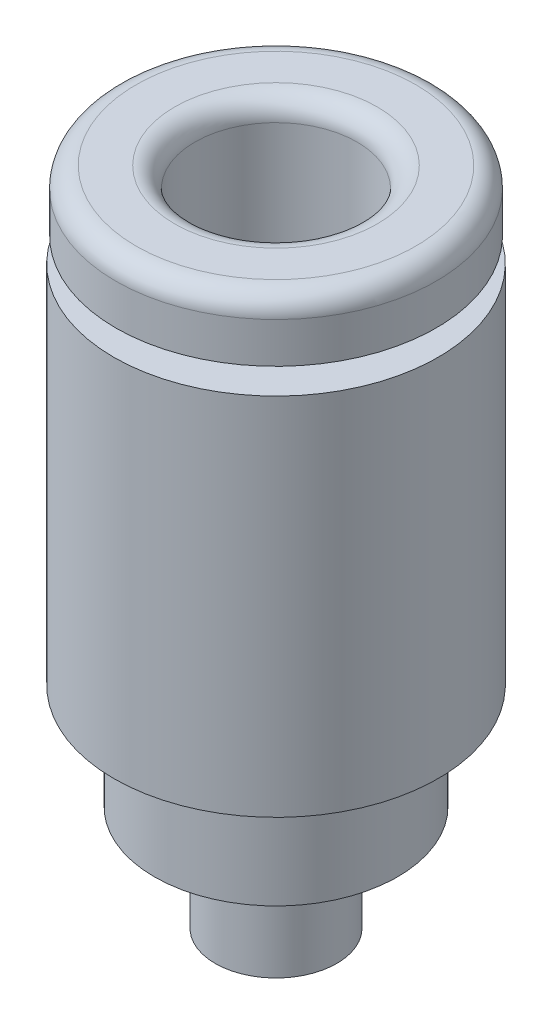
ISO-10303-21;
HEADER;
FILE_DESCRIPTION(('STEP AP214'),'2;1');
FILE_NAME('part.step','',(''),(''),'','','');
FILE_SCHEMA(('AUTOMOTIVE_DESIGN { 1 0 10303 214 1 1 1 1 }'));
ENDSEC;
DATA;
#1=APPLICATION_CONTEXT('core data for automotive mechanical design processes');
#2=APPLICATION_PROTOCOL_DEFINITION('international standard','automotive_design',2000,#1);
#3=PRODUCT_CONTEXT('',#1,'mechanical');
#4=PRODUCT('Part','Part','',(#3));
#5=PRODUCT_RELATED_PRODUCT_CATEGORY('part','',(#4));
#6=PRODUCT_DEFINITION_FORMATION('','',#4);
#7=PRODUCT_DEFINITION_CONTEXT('part definition',#1,'design');
#8=PRODUCT_DEFINITION('design','',#6,#7);
#9=PRODUCT_DEFINITION_SHAPE('','',#8);
#10=(LENGTH_UNIT() NAMED_UNIT(*) SI_UNIT(.MILLI.,.METRE.));
#11=(NAMED_UNIT(*) PLANE_ANGLE_UNIT() SI_UNIT($,.RADIAN.));
#12=(NAMED_UNIT(*) SI_UNIT($,.STERADIAN.) SOLID_ANGLE_UNIT());
#13=UNCERTAINTY_MEASURE_WITH_UNIT(LENGTH_MEASURE(1.E-05),#10,'distance_accuracy_value','');
#14=(GEOMETRIC_REPRESENTATION_CONTEXT(3) GLOBAL_UNCERTAINTY_ASSIGNED_CONTEXT((#13)) GLOBAL_UNIT_ASSIGNED_CONTEXT((#10,
#11,#12)) REPRESENTATION_CONTEXT('',''));
#15=CARTESIAN_POINT('',(0.,0.,0.));
#16=DIRECTION('',(0.,0.,1.));
#17=DIRECTION('',(1.,0.,0.));
#18=AXIS2_PLACEMENT_3D('',#15,#16,#17);
#19=CARTESIAN_POINT('',(0.866025403784439,-16.3,0.));
#20=DIRECTION('',(0.866025403784439,0.,0.5));
#21=DIRECTION('',(0.5,0.,-0.866025403784439));
#22=AXIS2_PLACEMENT_3D('',#19,#20,#21);
#23=PLANE('',#22);
#24=DIRECTION('',(0.,1.,0.));
#25=VECTOR('',#24,1.);
#26=CARTESIAN_POINT('',(0.866025403784439,-16.3,0.));
#27=LINE('',#26,#25);
#28=CARTESIAN_POINT('',(0.866025403784439,-12.7,0.));
#29=VERTEX_POINT('',#28);
#30=CARTESIAN_POINT('',(0.866025403784439,-16.3,0.));
#31=VERTEX_POINT('',#30);
#32=EDGE_CURVE('E93',#29,#31,#27,.F.);
#33=ORIENTED_EDGE('',*,*,#32,.T.);
#34=DIRECTION('',(0.5,0.,-0.866025403784439));
#35=VECTOR('',#34,1.);
#36=CARTESIAN_POINT('',(0.866025403784439,-16.3,0.));
#37=LINE('',#36,#35);
#38=CARTESIAN_POINT('',(0.433012701892219,-16.3,0.75));
#39=VERTEX_POINT('',#38);
#40=EDGE_CURVE('E82',#39,#31,#37,.T.);
#41=ORIENTED_EDGE('',*,*,#40,.F.);
#42=DIRECTION('',(0.,1.,0.));
#43=VECTOR('',#42,1.);
#44=CARTESIAN_POINT('',(0.433012701892219,-16.3,0.75));
#45=LINE('',#44,#43);
#46=CARTESIAN_POINT('',(0.433012701892219,-12.7,0.75));
#47=VERTEX_POINT('',#46);
#48=EDGE_CURVE('E258',#39,#47,#45,.T.);
#49=ORIENTED_EDGE('',*,*,#48,.T.);
#50=DIRECTION('',(0.5,0.,-0.866025403784439));
#51=VECTOR('',#50,1.);
#52=CARTESIAN_POINT('',(0.866025403784439,-12.7,0.));
#53=LINE('',#52,#51);
#54=EDGE_CURVE('E77',#29,#47,#53,.F.);
#55=ORIENTED_EDGE('',*,*,#54,.F.);
#56=EDGE_LOOP('',(#33,#41,#49,#55));
#57=FACE_BOUND('',#56,.T.);
#58=ADVANCED_FACE('F16',(#57),#23,.F.);
#59=CARTESIAN_POINT('',(0.433012701892219,-16.3,-0.75));
#60=DIRECTION('',(0.866025403784439,0.,-0.5));
#61=DIRECTION('',(-0.5,0.,-0.866025403784439));
#62=AXIS2_PLACEMENT_3D('',#59,#60,#61);
#63=PLANE('',#62);
#64=DIRECTION('',(0.,1.,0.));
#65=VECTOR('',#64,1.);
#66=CARTESIAN_POINT('',(0.433012701892219,-16.3,-0.75));
#67=LINE('',#66,#65);
#68=CARTESIAN_POINT('',(0.433012701892219,-12.7,-0.75));
#69=VERTEX_POINT('',#68);
#70=CARTESIAN_POINT('',(0.433012701892219,-16.3,-0.75));
#71=VERTEX_POINT('',#70);
#72=EDGE_CURVE('E98',#69,#71,#67,.F.);
#73=ORIENTED_EDGE('',*,*,#72,.T.);
#74=DIRECTION('',(-0.5,0.,-0.866025403784439));
#75=VECTOR('',#74,1.);
#76=CARTESIAN_POINT('',(0.433012701892219,-16.3,-0.75));
#77=LINE('',#76,#75);
#78=EDGE_CURVE('E86',#31,#71,#77,.T.);
#79=ORIENTED_EDGE('',*,*,#78,.F.);
#80=ORIENTED_EDGE('',*,*,#32,.F.);
#81=DIRECTION('',(-0.5,0.,-0.866025403784439));
#82=VECTOR('',#81,1.);
#83=CARTESIAN_POINT('',(0.433012701892219,-12.7,-0.75));
#84=LINE('',#83,#82);
#85=EDGE_CURVE('E100',#69,#29,#84,.F.);
#86=ORIENTED_EDGE('',*,*,#85,.F.);
#87=EDGE_LOOP('',(#73,#79,#80,#86));
#88=FACE_BOUND('',#87,.T.);
#89=ADVANCED_FACE('F96',(#88),#63,.F.);
#90=CARTESIAN_POINT('',(0.433012701892219,-16.3,0.75));
#91=DIRECTION('',(0.,0.,1.));
#92=DIRECTION('',(1.,0.,0.));
#93=AXIS2_PLACEMENT_3D('',#90,#91,#92);
#94=PLANE('',#93);
#95=ORIENTED_EDGE('',*,*,#48,.F.);
#96=DIRECTION('',(1.,0.,0.));
#97=VECTOR('',#96,1.);
#98=CARTESIAN_POINT('',(0.433012701892219,-16.3,0.75));
#99=LINE('',#98,#97);
#100=CARTESIAN_POINT('',(-0.433012701892219,-16.3,0.75));
#101=VERTEX_POINT('',#100);
#102=EDGE_CURVE('E89',#101,#39,#99,.T.);
#103=ORIENTED_EDGE('',*,*,#102,.F.);
#104=DIRECTION('',(0.,1.,0.));
#105=VECTOR('',#104,1.);
#106=CARTESIAN_POINT('',(-0.433012701892219,-16.3,0.75));
#107=LINE('',#106,#105);
#108=CARTESIAN_POINT('',(-0.433012701892219,-12.7,0.75));
#109=VERTEX_POINT('',#108);
#110=EDGE_CURVE('E246',#101,#109,#107,.T.);
#111=ORIENTED_EDGE('',*,*,#110,.T.);
#112=DIRECTION('',(1.,0.,0.));
#113=VECTOR('',#112,1.);
#114=CARTESIAN_POINT('',(0.433012701892219,-12.7,0.75));
#115=LINE('',#114,#113);
#116=EDGE_CURVE('E254',#47,#109,#115,.F.);
#117=ORIENTED_EDGE('',*,*,#116,.F.);
#118=EDGE_LOOP('',(#95,#103,#111,#117));
#119=FACE_BOUND('',#118,.T.);
#120=ADVANCED_FACE('F261',(#119),#94,.F.);
#121=CARTESIAN_POINT('',(0.,0.,0.));
#122=DIRECTION('',(0.,1.,0.));
#123=DIRECTION('',(-1.,0.,0.));
#124=AXIS2_PLACEMENT_3D('',#121,#122,#123);
#125=CYLINDRICAL_SURFACE('',#124,2.);
#126=CARTESIAN_POINT('',(0.,-12.7,0.));
#127=DIRECTION('',(0.,1.,0.));
#128=DIRECTION('',(-1.,0.,0.));
#129=AXIS2_PLACEMENT_3D('',#126,#127,#128);
#130=CIRCLE('',#129,2.);
#131=CARTESIAN_POINT('',(-2.,-12.7,0.));
#132=VERTEX_POINT('',#131);
#133=EDGE_CURVE('E131',#132,#132,#130,.T.);
#134=ORIENTED_EDGE('',*,*,#133,.F.);
#135=EDGE_LOOP('',(#134));
#136=FACE_BOUND('',#135,.T.);
#137=CARTESIAN_POINT('',(0.,-0.500000000000001,0.));
#138=DIRECTION('',(0.,1.,0.));
#139=DIRECTION('',(-1.,0.,0.));
#140=AXIS2_PLACEMENT_3D('',#137,#138,#139);
#141=CIRCLE('',#140,2.);
#142=CARTESIAN_POINT('',(-2.,-0.500000000000001,0.));
#143=VERTEX_POINT('',#142);
#144=EDGE_CURVE('E134',#143,#143,#141,.F.);
#145=ORIENTED_EDGE('',*,*,#144,.F.);
#146=EDGE_LOOP('',(#145));
#147=FACE_BOUND('',#146,.T.);
#148=ADVANCED_FACE('F400',(#136,#147),#125,.F.);
#149=CARTESIAN_POINT('',(-0.433012701892219,-16.3,-0.75));
#150=DIRECTION('',(0.,0.,-1.));
#151=DIRECTION('',(-1.,0.,0.));
#152=AXIS2_PLACEMENT_3D('',#149,#150,#151);
#153=PLANE('',#152);
#154=DIRECTION('',(0.,1.,0.));
#155=VECTOR('',#154,1.);
#156=CARTESIAN_POINT('',(-0.433012701892219,-16.3,-0.75));
#157=LINE('',#156,#155);
#158=CARTESIAN_POINT('',(-0.433012701892219,-12.7,-0.75));
#159=VERTEX_POINT('',#158);
#160=CARTESIAN_POINT('',(-0.433012701892219,-16.3,-0.75));
#161=VERTEX_POINT('',#160);
#162=EDGE_CURVE('E219',#159,#161,#157,.F.);
#163=ORIENTED_EDGE('',*,*,#162,.T.);
#164=DIRECTION('',(-1.,0.,0.));
#165=VECTOR('',#164,1.);
#166=CARTESIAN_POINT('',(-0.433012701892219,-16.3,-0.75));
#167=LINE('',#166,#165);
#168=EDGE_CURVE('E251',#71,#161,#167,.T.);
#169=ORIENTED_EDGE('',*,*,#168,.F.);
#170=ORIENTED_EDGE('',*,*,#72,.F.);
#171=DIRECTION('',(-1.,0.,0.));
#172=VECTOR('',#171,1.);
#173=CARTESIAN_POINT('',(0.,-12.7,-0.75));
#174=LINE('',#173,#172);
#175=EDGE_CURVE('E135',#159,#69,#174,.F.);
#176=ORIENTED_EDGE('',*,*,#175,.F.);
#177=EDGE_LOOP('',(#163,#169,#170,#176));
#178=FACE_BOUND('',#177,.T.);
#179=ADVANCED_FACE('F267',(#178),#153,.F.);
#180=CARTESIAN_POINT('',(-0.433012701892219,-16.3,0.75));
#181=DIRECTION('',(-0.866025403784439,0.,0.5));
#182=DIRECTION('',(0.5,0.,0.866025403784439));
#183=AXIS2_PLACEMENT_3D('',#180,#181,#182);
#184=PLANE('',#183);
#185=ORIENTED_EDGE('',*,*,#110,.F.);
#186=DIRECTION('',(0.5,0.,0.866025403784439));
#187=VECTOR('',#186,1.);
#188=CARTESIAN_POINT('',(-0.433012701892219,-16.3,0.75));
#189=LINE('',#188,#187);
#190=CARTESIAN_POINT('',(-0.866025403784439,-16.3,0.));
#191=VERTEX_POINT('',#190);
#192=EDGE_CURVE('E249',#191,#101,#189,.T.);
#193=ORIENTED_EDGE('',*,*,#192,.F.);
#194=DIRECTION('',(0.,1.,0.));
#195=VECTOR('',#194,1.);
#196=CARTESIAN_POINT('',(-0.866025403784439,-16.3,0.));
#197=LINE('',#196,#195);
#198=CARTESIAN_POINT('',(-0.866025403784439,-12.7,0.));
#199=VERTEX_POINT('',#198);
#200=EDGE_CURVE('E217',#191,#199,#197,.T.);
#201=ORIENTED_EDGE('',*,*,#200,.T.);
#202=DIRECTION('',(-0.5,0.,-0.866025403784439));
#203=VECTOR('',#202,1.);
#204=CARTESIAN_POINT('',(-0.433012701892219,-12.7,0.75));
#205=LINE('',#204,#203);
#206=EDGE_CURVE('E243',#109,#199,#205,.T.);
#207=ORIENTED_EDGE('',*,*,#206,.F.);
#208=EDGE_LOOP('',(#185,#193,#201,#207));
#209=FACE_BOUND('',#208,.T.);
#210=ADVANCED_FACE('F274',(#209),#184,.F.);
#211=CARTESIAN_POINT('',(0.,-12.7,0.));
#212=DIRECTION('',(0.,1.,0.));
#213=DIRECTION('',(-1.,0.,0.));
#214=AXIS2_PLACEMENT_3D('',#211,#212,#213);
#215=PLANE('',#214);
#216=ORIENTED_EDGE('',*,*,#133,.T.);
#217=EDGE_LOOP('',(#216));
#218=FACE_BOUND('',#217,.T.);
#219=ORIENTED_EDGE('',*,*,#54,.T.);
#220=ORIENTED_EDGE('',*,*,#116,.T.);
#221=ORIENTED_EDGE('',*,*,#206,.T.);
#222=DIRECTION('',(-0.5,0.,0.866025403784439));
#223=VECTOR('',#222,1.);
#224=CARTESIAN_POINT('',(-0.866025403784439,-12.7,0.));
#225=LINE('',#224,#223);
#226=EDGE_CURVE('E208',#199,#159,#225,.F.);
#227=ORIENTED_EDGE('',*,*,#226,.T.);
#228=ORIENTED_EDGE('',*,*,#175,.T.);
#229=ORIENTED_EDGE('',*,*,#85,.T.);
#230=EDGE_LOOP('',(#219,#220,#221,#227,#228,#229));
#231=FACE_BOUND('',#230,.T.);
#232=ADVANCED_FACE('F229',(#218,#231),#215,.T.);
#233=CARTESIAN_POINT('',(0.,-0.500000000000001,0.));
#234=DIRECTION('',(0.,1.,0.));
#235=DIRECTION('',(-1.,0.,0.));
#236=AXIS2_PLACEMENT_3D('',#233,#234,#235);
#237=TOROIDAL_SURFACE('',#236,2.5,0.5);
#238=ORIENTED_EDGE('',*,*,#144,.T.);
#239=EDGE_LOOP('',(#238));
#240=FACE_BOUND('',#239,.T.);
#241=CARTESIAN_POINT('',(0.,0.,0.));
#242=DIRECTION('',(0.,1.,0.));
#243=DIRECTION('',(-1.,0.,0.));
#244=AXIS2_PLACEMENT_3D('',#241,#242,#243);
#245=CIRCLE('',#244,2.5);
#246=CARTESIAN_POINT('',(-2.5,0.,0.));
#247=VERTEX_POINT('',#246);
#248=CARTESIAN_POINT('',(2.5,0.,0.));
#249=VERTEX_POINT('',#248);
#250=EDGE_CURVE('E162',#247,#249,#245,.T.);
#251=ORIENTED_EDGE('',*,*,#250,.T.);
#252=CARTESIAN_POINT('',(0.,0.,0.));
#253=DIRECTION('',(0.,1.,0.));
#254=DIRECTION('',(1.,0.,0.));
#255=AXIS2_PLACEMENT_3D('',#252,#253,#254);
#256=CIRCLE('',#255,2.5);
#257=EDGE_CURVE('E216',#249,#247,#256,.T.);
#258=ORIENTED_EDGE('',*,*,#257,.T.);
#259=EDGE_LOOP('',(#251,#258));
#260=FACE_BOUND('',#259,.T.);
#261=ADVANCED_FACE('F225',(#240,#260),#237,.T.);
#262=CARTESIAN_POINT('',(-0.866025403784439,-16.3,0.));
#263=DIRECTION('',(-0.866025403784439,0.,-0.5));
#264=DIRECTION('',(-0.5,0.,0.866025403784439));
#265=AXIS2_PLACEMENT_3D('',#262,#263,#264);
#266=PLANE('',#265);
#267=ORIENTED_EDGE('',*,*,#200,.F.);
#268=DIRECTION('',(0.5,0.,-0.866025403784438));
#269=VECTOR('',#268,1.);
#270=CARTESIAN_POINT('',(-0.866025403784439,-16.3,0.));
#271=LINE('',#270,#269);
#272=EDGE_CURVE('E160',#191,#161,#271,.T.);
#273=ORIENTED_EDGE('',*,*,#272,.T.);
#274=ORIENTED_EDGE('',*,*,#162,.F.);
#275=ORIENTED_EDGE('',*,*,#226,.F.);
#276=EDGE_LOOP('',(#267,#273,#274,#275));
#277=FACE_BOUND('',#276,.T.);
#278=ADVANCED_FACE('F177',(#277),#266,.F.);
#279=CARTESIAN_POINT('',(0.,0.,0.));
#280=DIRECTION('',(0.,-1.,0.));
#281=DIRECTION('',(0.,0.,-1.));
#282=AXIS2_PLACEMENT_3D('',#279,#280,#281);
#283=PLANE('',#282);
#284=ORIENTED_EDGE('',*,*,#257,.F.);
#285=ORIENTED_EDGE('',*,*,#250,.F.);
#286=EDGE_LOOP('',(#284,#285));
#287=FACE_BOUND('',#286,.T.);
#288=CARTESIAN_POINT('',(0.,0.,0.));
#289=DIRECTION('',(0.,-1.,0.));
#290=DIRECTION('',(0.,0.,1.));
#291=AXIS2_PLACEMENT_3D('',#288,#289,#290);
#292=CIRCLE('',#291,3.45);
#293=CARTESIAN_POINT('',(0.,0.,3.45));
#294=VERTEX_POINT('',#293);
#295=CARTESIAN_POINT('',(0.,0.,-3.45));
#296=VERTEX_POINT('',#295);
#297=EDGE_CURVE('E35',#294,#296,#292,.T.);
#298=ORIENTED_EDGE('',*,*,#297,.F.);
#299=CARTESIAN_POINT('',(0.,0.,0.));
#300=DIRECTION('',(0.,-1.,0.));
#301=DIRECTION('',(0.,0.,-1.));
#302=AXIS2_PLACEMENT_3D('',#299,#300,#301);
#303=CIRCLE('',#302,3.45);
#304=EDGE_CURVE('E130',#296,#294,#303,.T.);
#305=ORIENTED_EDGE('',*,*,#304,.F.);
#306=EDGE_LOOP('',(#298,#305));
#307=FACE_BOUND('',#306,.T.);
#308=ADVANCED_FACE('F168',(#287,#307),#283,.F.);
#309=CARTESIAN_POINT('',(0.,-16.3,0.));
#310=DIRECTION('',(0.,1.,0.));
#311=DIRECTION('',(0.,0.,1.));
#312=AXIS2_PLACEMENT_3D('',#309,#310,#311);
#313=PLANE('',#312);
#314=CARTESIAN_POINT('',(0.,-16.3,0.));
#315=DIRECTION('',(0.,1.,0.));
#316=DIRECTION('',(0.,0.,1.));
#317=AXIS2_PLACEMENT_3D('',#314,#315,#316);
#318=CIRCLE('',#317,1.5);
#319=CARTESIAN_POINT('',(0.,-16.3,1.5));
#320=VERTEX_POINT('',#319);
#321=EDGE_CURVE('E127',#320,#320,#318,.T.);
#322=ORIENTED_EDGE('',*,*,#321,.F.);
#323=EDGE_LOOP('',(#322));
#324=FACE_BOUND('',#323,.T.);
#325=ORIENTED_EDGE('',*,*,#192,.T.);
#326=ORIENTED_EDGE('',*,*,#102,.T.);
#327=ORIENTED_EDGE('',*,*,#40,.T.);
#328=ORIENTED_EDGE('',*,*,#78,.T.);
#329=ORIENTED_EDGE('',*,*,#168,.T.);
#330=ORIENTED_EDGE('',*,*,#272,.F.);
#331=EDGE_LOOP('',(#325,#326,#327,#328,#329,#330));
#332=FACE_BOUND('',#331,.T.);
#333=ADVANCED_FACE('F83',(#324,#332),#313,.F.);
#334=CARTESIAN_POINT('',(0.,-0.5,0.));
#335=DIRECTION('',(0.,1.,0.));
#336=DIRECTION('',(0.,0.,1.));
#337=AXIS2_PLACEMENT_3D('',#334,#335,#336);
#338=TOROIDAL_SURFACE('',#337,3.45,0.5);
#339=ORIENTED_EDGE('',*,*,#297,.T.);
#340=ORIENTED_EDGE('',*,*,#304,.T.);
#341=EDGE_LOOP('',(#339,#340));
#342=FACE_BOUND('',#341,.T.);
#343=CARTESIAN_POINT('',(0.,-0.5,0.));
#344=DIRECTION('',(0.,1.,0.));
#345=DIRECTION('',(0.,0.,1.));
#346=AXIS2_PLACEMENT_3D('',#343,#344,#345);
#347=CIRCLE('',#346,3.95);
#348=CARTESIAN_POINT('',(0.,-0.5,3.95));
#349=VERTEX_POINT('',#348);
#350=EDGE_CURVE('E126',#349,#349,#347,.F.);
#351=ORIENTED_EDGE('',*,*,#350,.F.);
#352=EDGE_LOOP('',(#351));
#353=FACE_BOUND('',#352,.T.);
#354=ADVANCED_FACE('F141',(#342,#353),#338,.T.);
#355=CARTESIAN_POINT('',(0.,-20.5426406871193,0.));
#356=DIRECTION('',(0.,1.,0.));
#357=DIRECTION('',(0.,0.,1.));
#358=AXIS2_PLACEMENT_3D('',#355,#356,#357);
#359=CYLINDRICAL_SURFACE('',#358,1.5);
#360=CARTESIAN_POINT('',(0.,-13.7,0.));
#361=DIRECTION('',(0.,1.,0.));
#362=DIRECTION('',(0.,0.,1.));
#363=AXIS2_PLACEMENT_3D('',#360,#361,#362);
#364=CIRCLE('',#363,1.5);
#365=CARTESIAN_POINT('',(0.,-13.7,1.5));
#366=VERTEX_POINT('',#365);
#367=EDGE_CURVE('E123',#366,#366,#364,.F.);
#368=ORIENTED_EDGE('',*,*,#367,.T.);
#369=EDGE_LOOP('',(#368));
#370=FACE_BOUND('',#369,.T.);
#371=ORIENTED_EDGE('',*,*,#321,.T.);
#372=EDGE_LOOP('',(#371));
#373=FACE_BOUND('',#372,.T.);
#374=ADVANCED_FACE('F152',(#370,#373),#359,.T.);
#375=CARTESIAN_POINT('',(0.,0.,0.));
#376=DIRECTION('',(0.,1.,0.));
#377=DIRECTION('',(0.,0.,1.));
#378=AXIS2_PLACEMENT_3D('',#375,#376,#377);
#379=CYLINDRICAL_SURFACE('',#378,3.95);
#380=ORIENTED_EDGE('',*,*,#350,.T.);
#381=EDGE_LOOP('',(#380));
#382=FACE_BOUND('',#381,.T.);
#383=CARTESIAN_POINT('',(0.,-1.5,0.));
#384=DIRECTION('',(0.,1.,0.));
#385=DIRECTION('',(0.,0.,1.));
#386=AXIS2_PLACEMENT_3D('',#383,#384,#385);
#387=CIRCLE('',#386,3.95);
#388=CARTESIAN_POINT('',(0.,-1.5,3.95));
#389=VERTEX_POINT('',#388);
#390=EDGE_CURVE('E120',#389,#389,#387,.T.);
#391=ORIENTED_EDGE('',*,*,#390,.T.);
#392=EDGE_LOOP('',(#391));
#393=FACE_BOUND('',#392,.T.);
#394=ADVANCED_FACE('F310',(#382,#393),#379,.T.);
#395=CARTESIAN_POINT('',(0.,-13.7,0.));
#396=DIRECTION('',(0.,1.,0.));
#397=DIRECTION('',(0.,0.,1.));
#398=AXIS2_PLACEMENT_3D('',#395,#396,#397);
#399=PLANE('',#398);
#400=CARTESIAN_POINT('',(0.,-13.7,0.));
#401=DIRECTION('',(0.,1.,0.));
#402=DIRECTION('',(0.,0.,1.));
#403=AXIS2_PLACEMENT_3D('',#400,#401,#402);
#404=CIRCLE('',#403,3.);
#405=CARTESIAN_POINT('',(0.,-13.7,3.));
#406=VERTEX_POINT('',#405);
#407=EDGE_CURVE('E117',#406,#406,#404,.T.);
#408=ORIENTED_EDGE('',*,*,#407,.F.);
#409=EDGE_LOOP('',(#408));
#410=FACE_BOUND('',#409,.T.);
#411=ORIENTED_EDGE('',*,*,#367,.F.);
#412=EDGE_LOOP('',(#411));
#413=FACE_BOUND('',#412,.T.);
#414=ADVANCED_FACE('F307',(#410,#413),#399,.F.);
#415=CARTESIAN_POINT('',(3.95,-1.5,0.));
#416=DIRECTION('',(0.,1.,0.));
#417=DIRECTION('',(0.,0.,1.));
#418=AXIS2_PLACEMENT_3D('',#415,#416,#417);
#419=PLANE('',#418);
#420=CARTESIAN_POINT('',(0.,-1.5,0.));
#421=DIRECTION('',(0.,1.,0.));
#422=DIRECTION('',(0.,0.,1.));
#423=AXIS2_PLACEMENT_3D('',#420,#421,#422);
#424=CIRCLE('',#423,2.195);
#425=CARTESIAN_POINT('',(0.,-1.5,2.195));
#426=VERTEX_POINT('',#425);
#427=EDGE_CURVE('E114',#426,#426,#424,.F.);
#428=ORIENTED_EDGE('',*,*,#427,.F.);
#429=EDGE_LOOP('',(#428));
#430=FACE_BOUND('',#429,.T.);
#431=ORIENTED_EDGE('',*,*,#390,.F.);
#432=EDGE_LOOP('',(#431));
#433=FACE_BOUND('',#432,.T.);
#434=ADVANCED_FACE('F303',(#430,#433),#419,.F.);
#435=CARTESIAN_POINT('',(0.,-22.1852813742386,0.));
#436=DIRECTION('',(0.,1.,0.));
#437=DIRECTION('',(0.,0.,1.));
#438=AXIS2_PLACEMENT_3D('',#435,#436,#437);
#439=CYLINDRICAL_SURFACE('',#438,3.);
#440=CARTESIAN_POINT('',(0.,-11.1,0.));
#441=DIRECTION('',(0.,1.,0.));
#442=DIRECTION('',(0.,0.,1.));
#443=AXIS2_PLACEMENT_3D('',#440,#441,#442);
#444=CIRCLE('',#443,3.);
#445=CARTESIAN_POINT('',(0.,-11.1,3.));
#446=VERTEX_POINT('',#445);
#447=EDGE_CURVE('E111',#446,#446,#444,.F.);
#448=ORIENTED_EDGE('',*,*,#447,.T.);
#449=EDGE_LOOP('',(#448));
#450=FACE_BOUND('',#449,.T.);
#451=ORIENTED_EDGE('',*,*,#407,.T.);
#452=EDGE_LOOP('',(#451));
#453=FACE_BOUND('',#452,.T.);
#454=ADVANCED_FACE('F299',(#450,#453),#439,.T.);
#455=CARTESIAN_POINT('',(0.,0.,0.));
#456=DIRECTION('',(0.,1.,0.));
#457=DIRECTION('',(0.,0.,1.));
#458=AXIS2_PLACEMENT_3D('',#455,#456,#457);
#459=CYLINDRICAL_SURFACE('',#458,2.195);
#460=CARTESIAN_POINT('',(0.,-2.1,0.));
#461=DIRECTION('',(0.,1.,0.));
#462=DIRECTION('',(0.,0.,1.));
#463=AXIS2_PLACEMENT_3D('',#460,#461,#462);
#464=CIRCLE('',#463,2.195);
#465=CARTESIAN_POINT('',(0.,-2.1,2.195));
#466=VERTEX_POINT('',#465);
#467=EDGE_CURVE('E108',#466,#466,#464,.F.);
#468=ORIENTED_EDGE('',*,*,#467,.F.);
#469=EDGE_LOOP('',(#468));
#470=FACE_BOUND('',#469,.T.);
#471=ORIENTED_EDGE('',*,*,#427,.T.);
#472=EDGE_LOOP('',(#471));
#473=FACE_BOUND('',#472,.T.);
#474=ADVANCED_FACE('F295',(#470,#473),#459,.T.);
#475=CARTESIAN_POINT('',(0.,-11.1,0.));
#476=DIRECTION('',(0.,1.,0.));
#477=DIRECTION('',(0.,0.,1.));
#478=AXIS2_PLACEMENT_3D('',#475,#476,#477);
#479=PLANE('',#478);
#480=CARTESIAN_POINT('',(0.,-11.1,0.));
#481=DIRECTION('',(0.,1.,0.));
#482=DIRECTION('',(0.,0.,1.));
#483=AXIS2_PLACEMENT_3D('',#480,#481,#482);
#484=CIRCLE('',#483,4.);
#485=CARTESIAN_POINT('',(0.,-11.1,4.));
#486=VERTEX_POINT('',#485);
#487=EDGE_CURVE('E27',#486,#486,#484,.T.);
#488=ORIENTED_EDGE('',*,*,#487,.F.);
#489=EDGE_LOOP('',(#488));
#490=FACE_BOUND('',#489,.T.);
#491=ORIENTED_EDGE('',*,*,#447,.F.);
#492=EDGE_LOOP('',(#491));
#493=FACE_BOUND('',#492,.T.);
#494=ADVANCED_FACE('F288',(#490,#493),#479,.F.);
#495=CARTESIAN_POINT('',(0.,-2.1,0.));
#496=DIRECTION('',(0.,1.,0.));
#497=DIRECTION('',(0.,0.,1.));
#498=AXIS2_PLACEMENT_3D('',#495,#496,#497);
#499=PLANE('',#498);
#500=ORIENTED_EDGE('',*,*,#467,.T.);
#501=EDGE_LOOP('',(#500));
#502=FACE_BOUND('',#501,.T.);
#503=CARTESIAN_POINT('',(0.,-2.1,0.));
#504=DIRECTION('',(0.,1.,0.));
#505=DIRECTION('',(0.,0.,1.));
#506=AXIS2_PLACEMENT_3D('',#503,#504,#505);
#507=CIRCLE('',#506,4.);
#508=CARTESIAN_POINT('',(0.,-2.1,4.));
#509=VERTEX_POINT('',#508);
#510=EDGE_CURVE('E10',#509,#509,#507,.F.);
#511=ORIENTED_EDGE('',*,*,#510,.F.);
#512=EDGE_LOOP('',(#511));
#513=FACE_BOUND('',#512,.T.);
#514=ADVANCED_FACE('F282',(#502,#513),#499,.T.);
#515=CARTESIAN_POINT('',(0.,-22.4137084989848,0.));
#516=DIRECTION('',(0.,1.,0.));
#517=DIRECTION('',(0.,0.,1.));
#518=AXIS2_PLACEMENT_3D('',#515,#516,#517);
#519=CYLINDRICAL_SURFACE('',#518,4.);
#520=ORIENTED_EDGE('',*,*,#510,.T.);
#521=EDGE_LOOP('',(#520));
#522=FACE_BOUND('',#521,.T.);
#523=ORIENTED_EDGE('',*,*,#487,.T.);
#524=EDGE_LOOP('',(#523));
#525=FACE_BOUND('',#524,.T.);
#526=ADVANCED_FACE('F280',(#522,#525),#519,.T.);
#527=CLOSED_SHELL('',(#58,#89,#120,#148,#179,#210,#232,#261,#278,#308,#333,#354,#374,#394,#414,
#434,#454,#474,#494,#514,#526));
#528=MANIFOLD_SOLID_BREP('B1',#527);
#529=ADVANCED_BREP_SHAPE_REPRESENTATION('',(#18,#528),#14);
#530=SHAPE_DEFINITION_REPRESENTATION(#9,#529);
ENDSEC;
END-ISO-10303-21;
